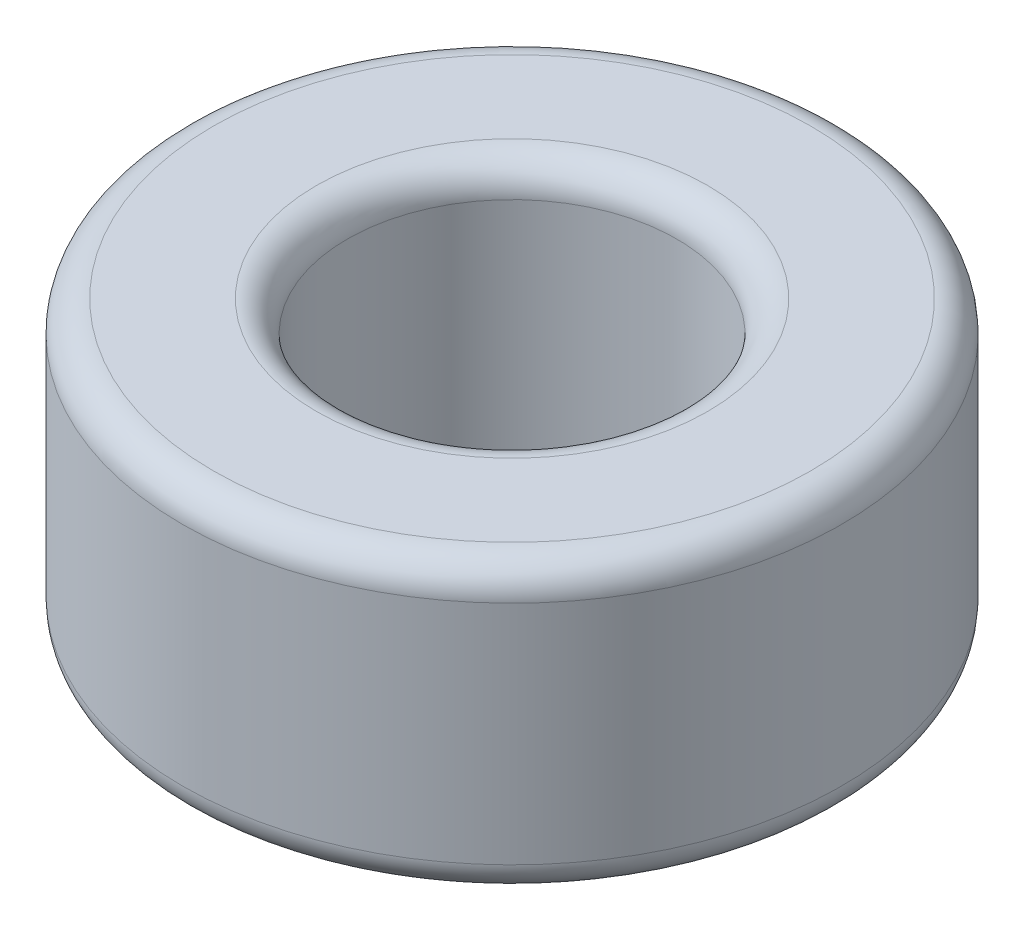
ISO-10303-21;
HEADER;
FILE_DESCRIPTION(('STEP AP214'),'2;1');
FILE_NAME('part.step','',(''),(''),'','','');
FILE_SCHEMA(('AUTOMOTIVE_DESIGN { 1 0 10303 214 1 1 1 1 }'));
ENDSEC;
DATA;
#1=APPLICATION_CONTEXT('core data for automotive mechanical design processes');
#2=APPLICATION_PROTOCOL_DEFINITION('international standard','automotive_design',2000,#1);
#3=PRODUCT_CONTEXT('',#1,'mechanical');
#4=PRODUCT('Part','Part','',(#3));
#5=PRODUCT_RELATED_PRODUCT_CATEGORY('part','',(#4));
#6=PRODUCT_DEFINITION_FORMATION('','',#4);
#7=PRODUCT_DEFINITION_CONTEXT('part definition',#1,'design');
#8=PRODUCT_DEFINITION('design','',#6,#7);
#9=PRODUCT_DEFINITION_SHAPE('','',#8);
#10=(LENGTH_UNIT() NAMED_UNIT(*) SI_UNIT(.MILLI.,.METRE.));
#11=(NAMED_UNIT(*) PLANE_ANGLE_UNIT() SI_UNIT($,.RADIAN.));
#12=(NAMED_UNIT(*) SI_UNIT($,.STERADIAN.) SOLID_ANGLE_UNIT());
#13=UNCERTAINTY_MEASURE_WITH_UNIT(LENGTH_MEASURE(1.E-05),#10,'distance_accuracy_value','');
#14=(GEOMETRIC_REPRESENTATION_CONTEXT(3) GLOBAL_UNCERTAINTY_ASSIGNED_CONTEXT((#13)) GLOBAL_UNIT_ASSIGNED_CONTEXT((#10,
#11,#12)) REPRESENTATION_CONTEXT('',''));
#15=CARTESIAN_POINT('',(0.,0.,0.));
#16=DIRECTION('',(0.,0.,1.));
#17=DIRECTION('',(1.,0.,0.));
#18=AXIS2_PLACEMENT_3D('',#15,#16,#17);
#19=CARTESIAN_POINT('',(0.,177.8,0.));
#20=DIRECTION('',(0.,-1.,0.));
#21=DIRECTION('',(0.,0.,-1.));
#22=AXIS2_PLACEMENT_3D('',#19,#20,#21);
#23=CYLINDRICAL_SURFACE('',#22,203.2);
#24=CARTESIAN_POINT('',(0.,19.05,0.));
#25=DIRECTION('',(0.,1.,0.));
#26=DIRECTION('',(0.,0.,1.));
#27=AXIS2_PLACEMENT_3D('',#24,#25,#26);
#28=CIRCLE('',#27,203.2);
#29=CARTESIAN_POINT('',(0.,19.05,203.2));
#30=VERTEX_POINT('',#29);
#31=EDGE_CURVE('E101',#30,#30,#28,.T.);
#32=ORIENTED_EDGE('',*,*,#31,.T.);
#33=EDGE_LOOP('',(#32));
#34=FACE_BOUND('',#33,.T.);
#35=CARTESIAN_POINT('',(0.,158.75,0.));
#36=DIRECTION('',(0.,1.,0.));
#37=DIRECTION('',(0.,0.,1.));
#38=AXIS2_PLACEMENT_3D('',#35,#36,#37);
#39=CIRCLE('',#38,203.2);
#40=CARTESIAN_POINT('',(0.,158.75,203.2));
#41=VERTEX_POINT('',#40);
#42=EDGE_CURVE('E106',#41,#41,#39,.F.);
#43=ORIENTED_EDGE('',*,*,#42,.T.);
#44=EDGE_LOOP('',(#43));
#45=FACE_BOUND('',#44,.T.);
#46=ADVANCED_FACE('F49',(#34,#45),#23,.T.);
#47=CARTESIAN_POINT('',(0.,177.8,0.));
#48=DIRECTION('',(0.,1.,0.));
#49=DIRECTION('',(0.,0.,1.));
#50=AXIS2_PLACEMENT_3D('',#47,#48,#49);
#51=PLANE('',#50);
#52=CARTESIAN_POINT('',(0.,177.8,0.));
#53=DIRECTION('',(0.,1.,0.));
#54=DIRECTION('',(0.,0.,1.));
#55=AXIS2_PLACEMENT_3D('',#52,#53,#54);
#56=CIRCLE('',#55,120.65);
#57=CARTESIAN_POINT('',(0.,177.8,120.65));
#58=VERTEX_POINT('',#57);
#59=EDGE_CURVE('E120',#58,#58,#56,.F.);
#60=ORIENTED_EDGE('',*,*,#59,.T.);
#61=EDGE_LOOP('',(#60));
#62=FACE_BOUND('',#61,.T.);
#63=CARTESIAN_POINT('',(0.,177.8,0.));
#64=DIRECTION('',(0.,1.,0.));
#65=DIRECTION('',(0.,0.,1.));
#66=AXIS2_PLACEMENT_3D('',#63,#64,#65);
#67=CIRCLE('',#66,184.15);
#68=CARTESIAN_POINT('',(0.,177.8,184.15));
#69=VERTEX_POINT('',#68);
#70=EDGE_CURVE('E124',#69,#69,#67,.T.);
#71=ORIENTED_EDGE('',*,*,#70,.T.);
#72=EDGE_LOOP('',(#71));
#73=FACE_BOUND('',#72,.T.);
#74=ADVANCED_FACE('F129',(#62,#73),#51,.T.);
#75=CARTESIAN_POINT('',(0.,0.,0.));
#76=DIRECTION('',(0.,1.,0.));
#77=DIRECTION('',(0.,0.,1.));
#78=AXIS2_PLACEMENT_3D('',#75,#76,#77);
#79=PLANE('',#78);
#80=CARTESIAN_POINT('',(0.,0.,0.));
#81=DIRECTION('',(0.,1.,0.));
#82=DIRECTION('',(0.,0.,1.));
#83=AXIS2_PLACEMENT_3D('',#80,#81,#82);
#84=CIRCLE('',#83,184.15);
#85=CARTESIAN_POINT('',(0.,0.,184.15));
#86=VERTEX_POINT('',#85);
#87=EDGE_CURVE('E68',#86,#86,#84,.F.);
#88=ORIENTED_EDGE('',*,*,#87,.T.);
#89=EDGE_LOOP('',(#88));
#90=FACE_BOUND('',#89,.T.);
#91=CARTESIAN_POINT('',(0.,0.,0.));
#92=DIRECTION('',(0.,1.,0.));
#93=DIRECTION('',(0.,0.,1.));
#94=AXIS2_PLACEMENT_3D('',#91,#92,#93);
#95=CIRCLE('',#94,120.65);
#96=CARTESIAN_POINT('',(0.,0.,120.65));
#97=VERTEX_POINT('',#96);
#98=EDGE_CURVE('E96',#97,#97,#95,.T.);
#99=ORIENTED_EDGE('',*,*,#98,.T.);
#100=EDGE_LOOP('',(#99));
#101=FACE_BOUND('',#100,.T.);
#102=ADVANCED_FACE('F151',(#90,#101),#79,.F.);
#103=CARTESIAN_POINT('',(0.,177.8,0.));
#104=DIRECTION('',(0.,-1.,0.));
#105=DIRECTION('',(0.,0.,-1.));
#106=AXIS2_PLACEMENT_3D('',#103,#104,#105);
#107=CYLINDRICAL_SURFACE('',#106,101.6);
#108=CARTESIAN_POINT('',(0.,158.75,0.));
#109=DIRECTION('',(0.,1.,0.));
#110=DIRECTION('',(0.,0.,1.));
#111=AXIS2_PLACEMENT_3D('',#108,#109,#110);
#112=CIRCLE('',#111,101.6);
#113=CARTESIAN_POINT('',(0.,158.75,101.6));
#114=VERTEX_POINT('',#113);
#115=EDGE_CURVE('E112',#114,#114,#112,.T.);
#116=ORIENTED_EDGE('',*,*,#115,.T.);
#117=EDGE_LOOP('',(#116));
#118=FACE_BOUND('',#117,.T.);
#119=CARTESIAN_POINT('',(0.,19.05,0.));
#120=DIRECTION('',(0.,1.,0.));
#121=DIRECTION('',(0.,0.,1.));
#122=AXIS2_PLACEMENT_3D('',#119,#120,#121);
#123=CIRCLE('',#122,101.6);
#124=CARTESIAN_POINT('',(0.,19.05,101.6));
#125=VERTEX_POINT('',#124);
#126=EDGE_CURVE('E116',#125,#125,#123,.F.);
#127=ORIENTED_EDGE('',*,*,#126,.T.);
#128=EDGE_LOOP('',(#127));
#129=FACE_BOUND('',#128,.T.);
#130=ADVANCED_FACE('F160',(#118,#129),#107,.F.);
#131=CARTESIAN_POINT('',(0.,158.75,0.));
#132=DIRECTION('',(0.,1.,0.));
#133=DIRECTION('',(0.,0.,1.));
#134=AXIS2_PLACEMENT_3D('',#131,#132,#133);
#135=TOROIDAL_SURFACE('',#134,120.65,19.05);
#136=ORIENTED_EDGE('',*,*,#115,.F.);
#137=EDGE_LOOP('',(#136));
#138=FACE_BOUND('',#137,.T.);
#139=ORIENTED_EDGE('',*,*,#59,.F.);
#140=EDGE_LOOP('',(#139));
#141=FACE_BOUND('',#140,.T.);
#142=ADVANCED_FACE('F157',(#138,#141),#135,.T.);
#143=CARTESIAN_POINT('',(0.,19.05,0.));
#144=DIRECTION('',(0.,1.,0.));
#145=DIRECTION('',(0.,0.,1.));
#146=AXIS2_PLACEMENT_3D('',#143,#144,#145);
#147=TOROIDAL_SURFACE('',#146,184.15,19.05);
#148=ORIENTED_EDGE('',*,*,#87,.F.);
#149=EDGE_LOOP('',(#148));
#150=FACE_BOUND('',#149,.T.);
#151=ORIENTED_EDGE('',*,*,#31,.F.);
#152=EDGE_LOOP('',(#151));
#153=FACE_BOUND('',#152,.T.);
#154=ADVANCED_FACE('F140',(#150,#153),#147,.T.);
#155=CARTESIAN_POINT('',(0.,19.05,0.));
#156=DIRECTION('',(0.,1.,0.));
#157=DIRECTION('',(0.,0.,1.));
#158=AXIS2_PLACEMENT_3D('',#155,#156,#157);
#159=TOROIDAL_SURFACE('',#158,120.65,19.05);
#160=ORIENTED_EDGE('',*,*,#126,.F.);
#161=EDGE_LOOP('',(#160));
#162=FACE_BOUND('',#161,.T.);
#163=ORIENTED_EDGE('',*,*,#98,.F.);
#164=EDGE_LOOP('',(#163));
#165=FACE_BOUND('',#164,.T.);
#166=ADVANCED_FACE('F133',(#162,#165),#159,.T.);
#167=CARTESIAN_POINT('',(0.,158.75,0.));
#168=DIRECTION('',(0.,1.,0.));
#169=DIRECTION('',(0.,0.,1.));
#170=AXIS2_PLACEMENT_3D('',#167,#168,#169);
#171=TOROIDAL_SURFACE('',#170,184.15,19.05);
#172=ORIENTED_EDGE('',*,*,#42,.F.);
#173=EDGE_LOOP('',(#172));
#174=FACE_BOUND('',#173,.T.);
#175=ORIENTED_EDGE('',*,*,#70,.F.);
#176=EDGE_LOOP('',(#175));
#177=FACE_BOUND('',#176,.T.);
#178=ADVANCED_FACE('F131',(#174,#177),#171,.T.);
#179=CLOSED_SHELL('',(#46,#74,#102,#130,#142,#154,#166,#178));
#180=CARTESIAN_POINT('',(0.,177.8,0.));
#181=DIRECTION('',(0.,-1.,0.));
#182=DIRECTION('',(0.,0.,-1.));
#183=AXIS2_PLACEMENT_3D('',#180,#181,#182);
#184=CYLINDRICAL_SURFACE('',#183,190.5);
#185=CARTESIAN_POINT('',(0.,19.05,0.));
#186=DIRECTION('',(0.,-1.,0.));
#187=DIRECTION('',(0.,0.,-1.));
#188=AXIS2_PLACEMENT_3D('',#185,#186,#187);
#189=CIRCLE('',#188,190.5);
#190=CARTESIAN_POINT('',(0.,19.05,-190.5));
#191=VERTEX_POINT('',#190);
#192=EDGE_CURVE('E53',#191,#191,#189,.F.);
#193=ORIENTED_EDGE('',*,*,#192,.F.);
#194=EDGE_LOOP('',(#193));
#195=FACE_BOUND('',#194,.T.);
#196=CARTESIAN_POINT('',(0.,158.75,0.));
#197=DIRECTION('',(0.,-1.,0.));
#198=DIRECTION('',(0.,0.,-1.));
#199=AXIS2_PLACEMENT_3D('',#196,#197,#198);
#200=CIRCLE('',#199,190.5);
#201=CARTESIAN_POINT('',(0.,158.75,-190.5));
#202=VERTEX_POINT('',#201);
#203=EDGE_CURVE('E85',#202,#202,#200,.T.);
#204=ORIENTED_EDGE('',*,*,#203,.F.);
#205=EDGE_LOOP('',(#204));
#206=FACE_BOUND('',#205,.T.);
#207=ADVANCED_FACE('F185',(#195,#206),#184,.F.);
#208=CARTESIAN_POINT('',(0.,165.1,0.));
#209=DIRECTION('',(0.,1.,0.));
#210=DIRECTION('',(0.,0.,1.));
#211=AXIS2_PLACEMENT_3D('',#208,#209,#210);
#212=PLANE('',#211);
#213=CARTESIAN_POINT('',(0.,165.1,0.));
#214=DIRECTION('',(0.,1.,0.));
#215=DIRECTION('',(0.,0.,1.));
#216=AXIS2_PLACEMENT_3D('',#213,#214,#215);
#217=CIRCLE('',#216,120.65);
#218=CARTESIAN_POINT('',(0.,165.1,120.65));
#219=VERTEX_POINT('',#218);
#220=EDGE_CURVE('E82',#219,#219,#217,.F.);
#221=ORIENTED_EDGE('',*,*,#220,.F.);
#222=EDGE_LOOP('',(#221));
#223=FACE_BOUND('',#222,.T.);
#224=CARTESIAN_POINT('',(0.,165.1,0.));
#225=DIRECTION('',(0.,1.,0.));
#226=DIRECTION('',(0.,0.,1.));
#227=AXIS2_PLACEMENT_3D('',#224,#225,#226);
#228=CIRCLE('',#227,184.15);
#229=CARTESIAN_POINT('',(0.,165.1,184.15));
#230=VERTEX_POINT('',#229);
#231=EDGE_CURVE('E78',#230,#230,#228,.T.);
#232=ORIENTED_EDGE('',*,*,#231,.F.);
#233=EDGE_LOOP('',(#232));
#234=FACE_BOUND('',#233,.T.);
#235=ADVANCED_FACE('F188',(#223,#234),#212,.F.);
#236=CARTESIAN_POINT('',(0.,12.7,0.));
#237=DIRECTION('',(0.,1.,0.));
#238=DIRECTION('',(0.,0.,1.));
#239=AXIS2_PLACEMENT_3D('',#236,#237,#238);
#240=PLANE('',#239);
#241=CARTESIAN_POINT('',(0.,12.7,0.));
#242=DIRECTION('',(0.,1.,0.));
#243=DIRECTION('',(0.,0.,1.));
#244=AXIS2_PLACEMENT_3D('',#241,#242,#243);
#245=CIRCLE('',#244,184.15);
#246=CARTESIAN_POINT('',(0.,12.7,184.15));
#247=VERTEX_POINT('',#246);
#248=EDGE_CURVE('E74',#247,#247,#245,.F.);
#249=ORIENTED_EDGE('',*,*,#248,.F.);
#250=EDGE_LOOP('',(#249));
#251=FACE_BOUND('',#250,.T.);
#252=CARTESIAN_POINT('',(0.,12.7,0.));
#253=DIRECTION('',(0.,1.,0.));
#254=DIRECTION('',(0.,0.,1.));
#255=AXIS2_PLACEMENT_3D('',#252,#253,#254);
#256=CIRCLE('',#255,120.65);
#257=CARTESIAN_POINT('',(0.,12.7,120.65));
#258=VERTEX_POINT('',#257);
#259=EDGE_CURVE('E65',#258,#258,#256,.T.);
#260=ORIENTED_EDGE('',*,*,#259,.F.);
#261=EDGE_LOOP('',(#260));
#262=FACE_BOUND('',#261,.T.);
#263=ADVANCED_FACE('F198',(#251,#262),#240,.T.);
#264=CARTESIAN_POINT('',(0.,177.8,0.));
#265=DIRECTION('',(0.,-1.,0.));
#266=DIRECTION('',(0.,0.,-1.));
#267=AXIS2_PLACEMENT_3D('',#264,#265,#266);
#268=CYLINDRICAL_SURFACE('',#267,114.3);
#269=CARTESIAN_POINT('',(0.,158.75,0.));
#270=DIRECTION('',(0.,-1.,0.));
#271=DIRECTION('',(0.,0.,-1.));
#272=AXIS2_PLACEMENT_3D('',#269,#270,#271);
#273=CIRCLE('',#272,114.3);
#274=CARTESIAN_POINT('',(0.,158.75,-114.3));
#275=VERTEX_POINT('',#274);
#276=EDGE_CURVE('E59',#275,#275,#273,.F.);
#277=ORIENTED_EDGE('',*,*,#276,.F.);
#278=EDGE_LOOP('',(#277));
#279=FACE_BOUND('',#278,.T.);
#280=CARTESIAN_POINT('',(0.,19.05,0.));
#281=DIRECTION('',(0.,-1.,0.));
#282=DIRECTION('',(0.,0.,-1.));
#283=AXIS2_PLACEMENT_3D('',#280,#281,#282);
#284=CIRCLE('',#283,114.3);
#285=CARTESIAN_POINT('',(0.,19.05,-114.3));
#286=VERTEX_POINT('',#285);
#287=EDGE_CURVE('E11',#286,#286,#284,.T.);
#288=ORIENTED_EDGE('',*,*,#287,.F.);
#289=EDGE_LOOP('',(#288));
#290=FACE_BOUND('',#289,.T.);
#291=ADVANCED_FACE('F208',(#279,#290),#268,.T.);
#292=CARTESIAN_POINT('',(0.,158.75,0.));
#293=DIRECTION('',(0.,1.,0.));
#294=DIRECTION('',(0.,0.,1.));
#295=AXIS2_PLACEMENT_3D('',#292,#293,#294);
#296=TOROIDAL_SURFACE('',#295,120.65,6.35);
#297=ORIENTED_EDGE('',*,*,#276,.T.);
#298=EDGE_LOOP('',(#297));
#299=FACE_BOUND('',#298,.T.);
#300=ORIENTED_EDGE('',*,*,#220,.T.);
#301=EDGE_LOOP('',(#300));
#302=FACE_BOUND('',#301,.T.);
#303=ADVANCED_FACE('F218',(#299,#302),#296,.F.);
#304=CARTESIAN_POINT('',(0.,19.05,0.));
#305=DIRECTION('',(0.,1.,0.));
#306=DIRECTION('',(0.,0.,1.));
#307=AXIS2_PLACEMENT_3D('',#304,#305,#306);
#308=TOROIDAL_SURFACE('',#307,184.15,6.35);
#309=ORIENTED_EDGE('',*,*,#248,.T.);
#310=EDGE_LOOP('',(#309));
#311=FACE_BOUND('',#310,.T.);
#312=ORIENTED_EDGE('',*,*,#192,.T.);
#313=EDGE_LOOP('',(#312));
#314=FACE_BOUND('',#313,.T.);
#315=ADVANCED_FACE('F228',(#311,#314),#308,.F.);
#316=CARTESIAN_POINT('',(0.,19.05,0.));
#317=DIRECTION('',(0.,1.,0.));
#318=DIRECTION('',(0.,0.,1.));
#319=AXIS2_PLACEMENT_3D('',#316,#317,#318);
#320=TOROIDAL_SURFACE('',#319,120.65,6.35);
#321=ORIENTED_EDGE('',*,*,#287,.T.);
#322=EDGE_LOOP('',(#321));
#323=FACE_BOUND('',#322,.T.);
#324=ORIENTED_EDGE('',*,*,#259,.T.);
#325=EDGE_LOOP('',(#324));
#326=FACE_BOUND('',#325,.T.);
#327=ADVANCED_FACE('F238',(#323,#326),#320,.F.);
#328=CARTESIAN_POINT('',(0.,158.75,0.));
#329=DIRECTION('',(0.,1.,0.));
#330=DIRECTION('',(0.,0.,1.));
#331=AXIS2_PLACEMENT_3D('',#328,#329,#330);
#332=TOROIDAL_SURFACE('',#331,184.15,6.35);
#333=ORIENTED_EDGE('',*,*,#203,.T.);
#334=EDGE_LOOP('',(#333));
#335=FACE_BOUND('',#334,.T.);
#336=ORIENTED_EDGE('',*,*,#231,.T.);
#337=EDGE_LOOP('',(#336));
#338=FACE_BOUND('',#337,.T.);
#339=ADVANCED_FACE('F51',(#335,#338),#332,.F.);
#340=CLOSED_SHELL('',(#207,#235,#263,#291,#303,#315,#327,#339));
#341=ORIENTED_CLOSED_SHELL('',*,#340,.T.);
#342=BREP_WITH_VOIDS('B2',#179,(#341));
#343=ADVANCED_BREP_SHAPE_REPRESENTATION('',(#18,#342),#14);
#344=SHAPE_DEFINITION_REPRESENTATION(#9,#343);
ENDSEC;
END-ISO-10303-21;
